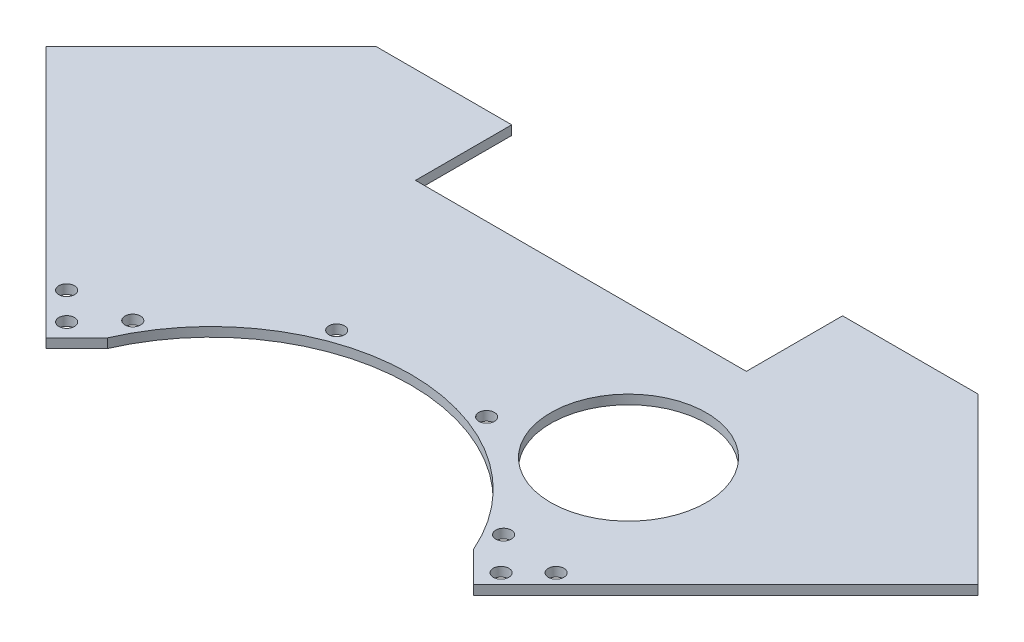
ISO-10303-21;
HEADER;
FILE_DESCRIPTION(('STEP AP214'),'2;1');
FILE_NAME('part.step','',(''),(''),'','','');
FILE_SCHEMA(('AUTOMOTIVE_DESIGN { 1 0 10303 214 1 1 1 1 }'));
ENDSEC;
DATA;
#1=APPLICATION_CONTEXT('core data for automotive mechanical design processes');
#2=APPLICATION_PROTOCOL_DEFINITION('international standard','automotive_design',2000,#1);
#3=PRODUCT_CONTEXT('',#1,'mechanical');
#4=PRODUCT('Part','Part','',(#3));
#5=PRODUCT_RELATED_PRODUCT_CATEGORY('part','',(#4));
#6=PRODUCT_DEFINITION_FORMATION('','',#4);
#7=PRODUCT_DEFINITION_CONTEXT('part definition',#1,'design');
#8=PRODUCT_DEFINITION('design','',#6,#7);
#9=PRODUCT_DEFINITION_SHAPE('','',#8);
#10=(LENGTH_UNIT() NAMED_UNIT(*) SI_UNIT(.MILLI.,.METRE.));
#11=(NAMED_UNIT(*) PLANE_ANGLE_UNIT() SI_UNIT($,.RADIAN.));
#12=(NAMED_UNIT(*) SI_UNIT($,.STERADIAN.) SOLID_ANGLE_UNIT());
#13=UNCERTAINTY_MEASURE_WITH_UNIT(LENGTH_MEASURE(1.E-05),#10,'distance_accuracy_value','');
#14=(GEOMETRIC_REPRESENTATION_CONTEXT(3) GLOBAL_UNCERTAINTY_ASSIGNED_CONTEXT((#13)) GLOBAL_UNIT_ASSIGNED_CONTEXT((#10,
#11,#12)) REPRESENTATION_CONTEXT('',''));
#15=CARTESIAN_POINT('',(0.,0.,0.));
#16=DIRECTION('',(0.,0.,1.));
#17=DIRECTION('',(1.,0.,0.));
#18=AXIS2_PLACEMENT_3D('',#15,#16,#17);
#19=CARTESIAN_POINT('',(0.,1.5113,0.));
#20=DIRECTION('',(0.,-1.,0.));
#21=DIRECTION('',(0.,0.,-1.));
#22=AXIS2_PLACEMENT_3D('',#19,#20,#21);
#23=CYLINDRICAL_SURFACE('',#22,65.0875);
#24=DIRECTION('',(0.,1.,0.));
#25=VECTOR('',#24,1.);
#26=CARTESIAN_POINT('',(-59.7182060728444,-1.5113,-25.8866475174228));
#27=LINE('',#26,#25);
#28=CARTESIAN_POINT('',(-59.7182060728444,-1.5113,-25.8866475174228));
#29=VERTEX_POINT('',#28);
#30=CARTESIAN_POINT('',(-59.7182060728444,1.5113,-25.8866475174228));
#31=VERTEX_POINT('',#30);
#32=EDGE_CURVE('E124',#29,#31,#27,.T.);
#33=ORIENTED_EDGE('',*,*,#32,.F.);
#34=CARTESIAN_POINT('',(0.,-1.5113,0.));
#35=DIRECTION('',(0.,-1.,0.));
#36=DIRECTION('',(0.,0.,-1.));
#37=AXIS2_PLACEMENT_3D('',#34,#35,#36);
#38=CIRCLE('',#37,65.0875);
#39=CARTESIAN_POINT('',(59.7182060728444,-1.5113,-25.8866475174228));
#40=VERTEX_POINT('',#39);
#41=EDGE_CURVE('E57',#29,#40,#38,.T.);
#42=ORIENTED_EDGE('',*,*,#41,.T.);
#43=DIRECTION('',(0.,1.,0.));
#44=VECTOR('',#43,1.);
#45=CARTESIAN_POINT('',(59.7182060728444,-1.5113,-25.8866475174228));
#46=LINE('',#45,#44);
#47=CARTESIAN_POINT('',(59.7182060728444,1.5113,-25.8866475174228));
#48=VERTEX_POINT('',#47);
#49=EDGE_CURVE('E243',#40,#48,#46,.T.);
#50=ORIENTED_EDGE('',*,*,#49,.T.);
#51=CARTESIAN_POINT('',(0.,1.5113,0.));
#52=DIRECTION('',(0.,-1.,0.));
#53=DIRECTION('',(0.,0.,-1.));
#54=AXIS2_PLACEMENT_3D('',#51,#52,#53);
#55=CIRCLE('',#54,65.0875);
#56=EDGE_CURVE('E132',#31,#48,#55,.T.);
#57=ORIENTED_EDGE('',*,*,#56,.F.);
#58=EDGE_LOOP('',(#33,#42,#50,#57));
#59=FACE_BOUND('',#58,.T.);
#60=ADVANCED_FACE('F35',(#59),#23,.F.);
#61=CARTESIAN_POINT('',(-152.04785216647,1.5113,-98.1663154400551));
#62=DIRECTION('',(0.707106781186547,0.,-0.707106781186548));
#63=DIRECTION('',(-0.707106781186548,0.,-0.707106781186547));
#64=AXIS2_PLACEMENT_3D('',#61,#62,#63);
#65=PLANE('',#64);
#66=DIRECTION('',(0.,1.,0.));
#67=VECTOR('',#66,1.);
#68=CARTESIAN_POINT('',(-69.7431951583412,-1.5113,-15.861658431926));
#69=LINE('',#68,#67);
#70=CARTESIAN_POINT('',(-69.7431951583411,-1.5113,-15.861658431926));
#71=VERTEX_POINT('',#70);
#72=CARTESIAN_POINT('',(-69.7431951583412,1.5113,-15.861658431926));
#73=VERTEX_POINT('',#72);
#74=EDGE_CURVE('E49',#71,#73,#69,.T.);
#75=ORIENTED_EDGE('',*,*,#74,.T.);
#76=DIRECTION('',(0.707106781186548,0.,0.707106781186547));
#77=VECTOR('',#76,1.);
#78=CARTESIAN_POINT('',(-152.04785216647,1.5113,-98.1663154400551));
#79=LINE('',#78,#77);
#80=CARTESIAN_POINT('',(-152.04785216647,1.5113,-98.1663154400551));
#81=VERTEX_POINT('',#80);
#82=EDGE_CURVE('E147',#81,#73,#79,.T.);
#83=ORIENTED_EDGE('',*,*,#82,.F.);
#84=DIRECTION('',(0.,-1.,0.));
#85=VECTOR('',#84,1.);
#86=CARTESIAN_POINT('',(-152.04785216647,1.5113,-98.1663154400551));
#87=LINE('',#86,#85);
#88=CARTESIAN_POINT('',(-152.04785216647,-1.5113,-98.1663154400551));
#89=VERTEX_POINT('',#88);
#90=EDGE_CURVE('E165',#81,#89,#87,.T.);
#91=ORIENTED_EDGE('',*,*,#90,.T.);
#92=DIRECTION('',(0.707106781186548,0.,0.707106781186547));
#93=VECTOR('',#92,1.);
#94=CARTESIAN_POINT('',(-152.04785216647,-1.5113,-98.1663154400551));
#95=LINE('',#94,#93);
#96=EDGE_CURVE('E163',#89,#71,#95,.T.);
#97=ORIENTED_EDGE('',*,*,#96,.T.);
#98=EDGE_LOOP('',(#75,#83,#91,#97));
#99=FACE_BOUND('',#98,.T.);
#100=ADVANCED_FACE('F222',(#99),#65,.F.);
#101=CARTESIAN_POINT('',(0.,1.5113,0.));
#102=DIRECTION('',(0.,-1.,0.));
#103=DIRECTION('',(0.,0.,-1.));
#104=AXIS2_PLACEMENT_3D('',#101,#102,#103);
#105=PLANE('',#104);
#106=CARTESIAN_POINT('',(59.1287540950455,1.5113,-77.0580926011515));
#107=DIRECTION('',(0.,1.,0.));
#108=DIRECTION('',(0.,0.,1.));
#109=AXIS2_PLACEMENT_3D('',#106,#107,#108);
#110=CIRCLE('',#109,25.4);
#111=CARTESIAN_POINT('',(59.1287540950455,1.5113,-51.6580926011515));
#112=VERTEX_POINT('',#111);
#113=EDGE_CURVE('E398',#112,#112,#110,.T.);
#114=ORIENTED_EDGE('',*,*,#113,.F.);
#115=EDGE_LOOP('',(#114));
#116=FACE_BOUND('',#115,.T.);
#117=CARTESIAN_POINT('',(-70.8657271734748,1.5113,-23.7193825378615));
#118=DIRECTION('',(0.,-1.,0.));
#119=DIRECTION('',(0.,0.,1.));
#120=AXIS2_PLACEMENT_3D('',#117,#118,#119);
#121=CIRCLE('',#120,2.55270000000001);
#122=CARTESIAN_POINT('',(-70.8657271734748,1.5113,-21.1666825378615));
#123=VERTEX_POINT('',#122);
#124=EDGE_CURVE('E404',#123,#123,#121,.T.);
#125=ORIENTED_EDGE('',*,*,#124,.T.);
#126=EDGE_LOOP('',(#125));
#127=FACE_BOUND('',#126,.T.);
#128=CARTESIAN_POINT('',(-79.8459832945439,1.5113,-32.6996386589307));
#129=DIRECTION('',(0.,-1.,0.));
#130=DIRECTION('',(0.,0.,1.));
#131=AXIS2_PLACEMENT_3D('',#128,#129,#130);
#132=CIRCLE('',#131,2.55270000000001);
#133=CARTESIAN_POINT('',(-79.8459832945439,1.5113,-30.1469386589307));
#134=VERTEX_POINT('',#133);
#135=EDGE_CURVE('E400',#134,#134,#132,.T.);
#136=ORIENTED_EDGE('',*,*,#135,.T.);
#137=EDGE_LOOP('',(#136));
#138=FACE_BOUND('',#137,.T.);
#139=CARTESIAN_POINT('',(24.4619855809739,1.5113,-65.4265524190006));
#140=DIRECTION('',(0.,1.,0.));
#141=DIRECTION('',(0.,0.,1.));
#142=AXIS2_PLACEMENT_3D('',#139,#140,#141);
#143=CIRCLE('',#142,2.5527);
#144=CARTESIAN_POINT('',(24.4619855809739,1.5113,-62.8738524190006));
#145=VERTEX_POINT('',#144);
#146=EDGE_CURVE('E144',#145,#145,#143,.T.);
#147=ORIENTED_EDGE('',*,*,#146,.F.);
#148=EDGE_LOOP('',(#147));
#149=FACE_BOUND('',#148,.T.);
#150=CARTESIAN_POINT('',(60.491874454343,1.5113,-34.9250000000001));
#151=DIRECTION('',(0.,1.,0.));
#152=DIRECTION('',(0.,0.,1.));
#153=AXIS2_PLACEMENT_3D('',#150,#151,#152);
#154=CIRCLE('',#153,2.5527);
#155=CARTESIAN_POINT('',(60.491874454343,1.5113,-32.3723000000001));
#156=VERTEX_POINT('',#155);
#157=EDGE_CURVE('E250',#156,#156,#154,.T.);
#158=ORIENTED_EDGE('',*,*,#157,.F.);
#159=EDGE_LOOP('',(#158));
#160=FACE_BOUND('',#159,.T.);
#161=CARTESIAN_POINT('',(-60.491874454343,1.5113,-34.9250000000001));
#162=DIRECTION('',(0.,1.,0.));
#163=DIRECTION('',(0.,0.,-1.));
#164=AXIS2_PLACEMENT_3D('',#161,#162,#163);
#165=CIRCLE('',#164,2.5527);
#166=CARTESIAN_POINT('',(-60.491874454343,1.5113,-37.4777000000001));
#167=VERTEX_POINT('',#166);
#168=EDGE_CURVE('E256',#167,#167,#165,.T.);
#169=ORIENTED_EDGE('',*,*,#168,.F.);
#170=EDGE_LOOP('',(#169));
#171=FACE_BOUND('',#170,.T.);
#172=CARTESIAN_POINT('',(-24.4619855809739,1.5113,-65.4265524190006));
#173=DIRECTION('',(0.,1.,0.));
#174=DIRECTION('',(0.,0.,-1.));
#175=AXIS2_PLACEMENT_3D('',#172,#173,#174);
#176=CIRCLE('',#175,2.5527);
#177=CARTESIAN_POINT('',(-24.4619855809739,1.5113,-67.9792524190005));
#178=VERTEX_POINT('',#177);
#179=EDGE_CURVE('E245',#178,#178,#176,.T.);
#180=ORIENTED_EDGE('',*,*,#179,.F.);
#181=EDGE_LOOP('',(#180));
#182=FACE_BOUND('',#181,.T.);
#183=CARTESIAN_POINT('',(79.8459832945439,1.5113,-32.6996386589307));
#184=DIRECTION('',(0.,1.,0.));
#185=DIRECTION('',(0.,0.,1.));
#186=AXIS2_PLACEMENT_3D('',#183,#184,#185);
#187=CIRCLE('',#186,2.55270000000001);
#188=CARTESIAN_POINT('',(79.8459832945439,1.5113,-30.1469386589307));
#189=VERTEX_POINT('',#188);
#190=EDGE_CURVE('E223',#189,#189,#187,.T.);
#191=ORIENTED_EDGE('',*,*,#190,.F.);
#192=EDGE_LOOP('',(#191));
#193=FACE_BOUND('',#192,.T.);
#194=CARTESIAN_POINT('',(70.8657271734748,1.5113,-23.7193825378615));
#195=DIRECTION('',(0.,1.,0.));
#196=DIRECTION('',(0.,0.,1.));
#197=AXIS2_PLACEMENT_3D('',#194,#195,#196);
#198=CIRCLE('',#197,2.55270000000001);
#199=CARTESIAN_POINT('',(70.8657271734748,1.5113,-21.1666825378615));
#200=VERTEX_POINT('',#199);
#201=EDGE_CURVE('E234',#200,#200,#198,.T.);
#202=ORIENTED_EDGE('',*,*,#201,.F.);
#203=EDGE_LOOP('',(#202));
#204=FACE_BOUND('',#203,.T.);
#205=DIRECTION('',(0.707106781186548,0.,-0.707106781186547));
#206=VECTOR('',#205,1.);
#207=CARTESIAN_POINT('',(-69.7431951583412,1.5113,-15.861658431926));
#208=LINE('',#207,#206);
#209=EDGE_CURVE('E129',#73,#31,#208,.T.);
#210=ORIENTED_EDGE('',*,*,#209,.T.);
#211=ORIENTED_EDGE('',*,*,#56,.T.);
#212=DIRECTION('',(-0.707106781186542,0.,-0.707106781186554));
#213=VECTOR('',#212,1.);
#214=CARTESIAN_POINT('',(60.762939037272,1.5113,-24.8419145529951));
#215=LINE('',#214,#213);
#216=CARTESIAN_POINT('',(69.7431951583412,1.5113,-15.861658431926));
#217=VERTEX_POINT('',#216);
#218=EDGE_CURVE('E233',#217,#48,#215,.T.);
#219=ORIENTED_EDGE('',*,*,#218,.F.);
#220=DIRECTION('',(0.707106781186548,0.,-0.707106781186547));
#221=VECTOR('',#220,1.);
#222=CARTESIAN_POINT('',(64.255461556707,1.5113,-10.3739248302919));
#223=LINE('',#222,#221);
#224=CARTESIAN_POINT('',(152.04785216647,1.5113,-98.1663154400552));
#225=VERTEX_POINT('',#224);
#226=EDGE_CURVE('E267',#217,#225,#223,.T.);
#227=ORIENTED_EDGE('',*,*,#226,.T.);
#228=DIRECTION('',(-0.707106781186548,0.,-0.707106781186547));
#229=VECTOR('',#228,1.);
#230=CARTESIAN_POINT('',(152.04785216647,1.5113,-98.1663154400552));
#231=LINE('',#230,#229);
#232=CARTESIAN_POINT('',(98.1663154400552,1.5113,-152.04785216647));
#233=VERTEX_POINT('',#232);
#234=EDGE_CURVE('E269',#225,#233,#231,.T.);
#235=ORIENTED_EDGE('',*,*,#234,.T.);
#236=DIRECTION('',(-1.,0.,0.));
#237=VECTOR('',#236,1.);
#238=CARTESIAN_POINT('',(98.1663154400552,1.5113,-152.04785216647));
#239=LINE('',#238,#237);
#240=CARTESIAN_POINT('',(53.9750000000001,1.5113,-152.04785216647));
#241=VERTEX_POINT('',#240);
#242=EDGE_CURVE('E189',#233,#241,#239,.T.);
#243=ORIENTED_EDGE('',*,*,#242,.T.);
#244=DIRECTION('',(0.,0.,1.));
#245=VECTOR('',#244,1.);
#246=CARTESIAN_POINT('',(53.9750000000001,1.5113,-152.04785216647));
#247=LINE('',#246,#245);
#248=CARTESIAN_POINT('',(53.9750000000001,1.5113,-120.65));
#249=VERTEX_POINT('',#248);
#250=EDGE_CURVE('E208',#241,#249,#247,.T.);
#251=ORIENTED_EDGE('',*,*,#250,.T.);
#252=DIRECTION('',(-1.,0.,0.));
#253=VECTOR('',#252,1.);
#254=CARTESIAN_POINT('',(53.9750000000001,1.5113,-120.65));
#255=LINE('',#254,#253);
#256=CARTESIAN_POINT('',(-53.975,1.5113,-120.65));
#257=VERTEX_POINT('',#256);
#258=EDGE_CURVE('E204',#249,#257,#255,.T.);
#259=ORIENTED_EDGE('',*,*,#258,.T.);
#260=DIRECTION('',(0.,0.,-1.));
#261=VECTOR('',#260,1.);
#262=CARTESIAN_POINT('',(-53.975,1.5113,-120.65));
#263=LINE('',#262,#261);
#264=CARTESIAN_POINT('',(-53.975,1.5113,-152.04785216647));
#265=VERTEX_POINT('',#264);
#266=EDGE_CURVE('E207',#257,#265,#263,.T.);
#267=ORIENTED_EDGE('',*,*,#266,.T.);
#268=DIRECTION('',(-1.,0.,0.));
#269=VECTOR('',#268,1.);
#270=CARTESIAN_POINT('',(-53.975,1.5113,-152.04785216647));
#271=LINE('',#270,#269);
#272=CARTESIAN_POINT('',(-98.1663154400551,1.5113,-152.04785216647));
#273=VERTEX_POINT('',#272);
#274=EDGE_CURVE('E210',#265,#273,#271,.T.);
#275=ORIENTED_EDGE('',*,*,#274,.T.);
#276=DIRECTION('',(-0.707106781186547,0.,0.707106781186547));
#277=VECTOR('',#276,1.);
#278=CARTESIAN_POINT('',(-98.1663154400551,1.5113,-152.04785216647));
#279=LINE('',#278,#277);
#280=EDGE_CURVE('E215',#273,#81,#279,.T.);
#281=ORIENTED_EDGE('',*,*,#280,.T.);
#282=ORIENTED_EDGE('',*,*,#82,.T.);
#283=EDGE_LOOP('',(#210,#211,#219,#227,#235,#243,#251,#259,#267,#275,#281,#282));
#284=FACE_BOUND('',#283,.T.);
#285=ADVANCED_FACE('F220',(#116,#127,#138,#149,#160,#171,#182,#193,#204,#284),#105,.F.);
#286=CARTESIAN_POINT('',(0.,-1.5113,0.));
#287=DIRECTION('',(0.,-1.,0.));
#288=DIRECTION('',(0.,0.,-1.));
#289=AXIS2_PLACEMENT_3D('',#286,#287,#288);
#290=PLANE('',#289);
#291=CARTESIAN_POINT('',(59.1287540950455,-1.5113,-77.0580926011515));
#292=DIRECTION('',(0.,1.,0.));
#293=DIRECTION('',(0.,0.,1.));
#294=AXIS2_PLACEMENT_3D('',#291,#292,#293);
#295=CIRCLE('',#294,25.4);
#296=CARTESIAN_POINT('',(59.1287540950455,-1.5113,-51.6580926011515));
#297=VERTEX_POINT('',#296);
#298=EDGE_CURVE('E336',#297,#297,#295,.T.);
#299=ORIENTED_EDGE('',*,*,#298,.T.);
#300=EDGE_LOOP('',(#299));
#301=FACE_BOUND('',#300,.T.);
#302=CARTESIAN_POINT('',(-70.8657271734748,-1.5113,-23.7193825378615));
#303=DIRECTION('',(0.,-1.,0.));
#304=DIRECTION('',(0.,0.,1.));
#305=AXIS2_PLACEMENT_3D('',#302,#303,#304);
#306=CIRCLE('',#305,2.55270000000001);
#307=CARTESIAN_POINT('',(-70.8657271734748,-1.5113,-21.1666825378615));
#308=VERTEX_POINT('',#307);
#309=EDGE_CURVE('E340',#308,#308,#306,.T.);
#310=ORIENTED_EDGE('',*,*,#309,.F.);
#311=EDGE_LOOP('',(#310));
#312=FACE_BOUND('',#311,.T.);
#313=CARTESIAN_POINT('',(-79.8459832945439,-1.5113,-32.6996386589307));
#314=DIRECTION('',(0.,-1.,0.));
#315=DIRECTION('',(0.,0.,1.));
#316=AXIS2_PLACEMENT_3D('',#313,#314,#315);
#317=CIRCLE('',#316,2.55270000000001);
#318=CARTESIAN_POINT('',(-79.8459832945439,-1.5113,-30.1469386589307));
#319=VERTEX_POINT('',#318);
#320=EDGE_CURVE('E344',#319,#319,#317,.T.);
#321=ORIENTED_EDGE('',*,*,#320,.F.);
#322=EDGE_LOOP('',(#321));
#323=FACE_BOUND('',#322,.T.);
#324=CARTESIAN_POINT('',(70.8657271734748,-1.5113,-23.7193825378615));
#325=DIRECTION('',(0.,1.,0.));
#326=DIRECTION('',(0.,0.,1.));
#327=AXIS2_PLACEMENT_3D('',#324,#325,#326);
#328=CIRCLE('',#327,2.55270000000001);
#329=CARTESIAN_POINT('',(70.8657271734748,-1.5113,-21.1666825378615));
#330=VERTEX_POINT('',#329);
#331=EDGE_CURVE('E230',#330,#330,#328,.T.);
#332=ORIENTED_EDGE('',*,*,#331,.T.);
#333=EDGE_LOOP('',(#332));
#334=FACE_BOUND('',#333,.T.);
#335=CARTESIAN_POINT('',(79.8459832945439,-1.5113,-32.6996386589307));
#336=DIRECTION('',(0.,1.,0.));
#337=DIRECTION('',(0.,0.,1.));
#338=AXIS2_PLACEMENT_3D('',#335,#336,#337);
#339=CIRCLE('',#338,2.55270000000001);
#340=CARTESIAN_POINT('',(79.8459832945439,-1.5113,-30.1469386589307));
#341=VERTEX_POINT('',#340);
#342=EDGE_CURVE('E226',#341,#341,#339,.T.);
#343=ORIENTED_EDGE('',*,*,#342,.T.);
#344=EDGE_LOOP('',(#343));
#345=FACE_BOUND('',#344,.T.);
#346=CARTESIAN_POINT('',(-24.4619855809739,-1.5113,-65.4265524190006));
#347=DIRECTION('',(0.,1.,0.));
#348=DIRECTION('',(0.,0.,-1.));
#349=AXIS2_PLACEMENT_3D('',#346,#347,#348);
#350=CIRCLE('',#349,2.5527);
#351=CARTESIAN_POINT('',(-24.4619855809739,-1.5113,-67.9792524190005));
#352=VERTEX_POINT('',#351);
#353=EDGE_CURVE('E259',#352,#352,#350,.T.);
#354=ORIENTED_EDGE('',*,*,#353,.T.);
#355=EDGE_LOOP('',(#354));
#356=FACE_BOUND('',#355,.T.);
#357=CARTESIAN_POINT('',(-60.491874454343,-1.5113,-34.9250000000001));
#358=DIRECTION('',(0.,1.,0.));
#359=DIRECTION('',(0.,0.,-1.));
#360=AXIS2_PLACEMENT_3D('',#357,#358,#359);
#361=CIRCLE('',#360,2.5527);
#362=CARTESIAN_POINT('',(-60.491874454343,-1.5113,-37.4777000000001));
#363=VERTEX_POINT('',#362);
#364=EDGE_CURVE('E253',#363,#363,#361,.T.);
#365=ORIENTED_EDGE('',*,*,#364,.T.);
#366=EDGE_LOOP('',(#365));
#367=FACE_BOUND('',#366,.T.);
#368=CARTESIAN_POINT('',(60.491874454343,-1.5113,-34.9250000000001));
#369=DIRECTION('',(0.,1.,0.));
#370=DIRECTION('',(0.,0.,1.));
#371=AXIS2_PLACEMENT_3D('',#368,#369,#370);
#372=CIRCLE('',#371,2.5527);
#373=CARTESIAN_POINT('',(60.491874454343,-1.5113,-32.3723000000001));
#374=VERTEX_POINT('',#373);
#375=EDGE_CURVE('E247',#374,#374,#372,.T.);
#376=ORIENTED_EDGE('',*,*,#375,.T.);
#377=EDGE_LOOP('',(#376));
#378=FACE_BOUND('',#377,.T.);
#379=CARTESIAN_POINT('',(24.4619855809739,-1.5113,-65.4265524190006));
#380=DIRECTION('',(0.,1.,0.));
#381=DIRECTION('',(0.,0.,1.));
#382=AXIS2_PLACEMENT_3D('',#379,#380,#381);
#383=CIRCLE('',#382,2.5527);
#384=CARTESIAN_POINT('',(24.4619855809739,-1.5113,-62.8738524190006));
#385=VERTEX_POINT('',#384);
#386=EDGE_CURVE('E139',#385,#385,#383,.T.);
#387=ORIENTED_EDGE('',*,*,#386,.T.);
#388=EDGE_LOOP('',(#387));
#389=FACE_BOUND('',#388,.T.);
#390=ORIENTED_EDGE('',*,*,#41,.F.);
#391=DIRECTION('',(0.707106781186542,0.,-0.707106781186554));
#392=VECTOR('',#391,1.);
#393=CARTESIAN_POINT('',(-60.762939037272,-1.5113,-24.8419145529951));
#394=LINE('',#393,#392);
#395=EDGE_CURVE('E122',#71,#29,#394,.T.);
#396=ORIENTED_EDGE('',*,*,#395,.F.);
#397=ORIENTED_EDGE('',*,*,#96,.F.);
#398=DIRECTION('',(-0.707106781186547,0.,0.707106781186547));
#399=VECTOR('',#398,1.);
#400=CARTESIAN_POINT('',(-98.1663154400551,-1.5113,-152.04785216647));
#401=LINE('',#400,#399);
#402=CARTESIAN_POINT('',(-98.1663154400551,-1.5113,-152.04785216647));
#403=VERTEX_POINT('',#402);
#404=EDGE_CURVE('E161',#403,#89,#401,.T.);
#405=ORIENTED_EDGE('',*,*,#404,.F.);
#406=DIRECTION('',(-1.,0.,0.));
#407=VECTOR('',#406,1.);
#408=CARTESIAN_POINT('',(-53.975,-1.5113,-152.04785216647));
#409=LINE('',#408,#407);
#410=CARTESIAN_POINT('',(-53.975,-1.5113,-152.04785216647));
#411=VERTEX_POINT('',#410);
#412=EDGE_CURVE('E159',#411,#403,#409,.T.);
#413=ORIENTED_EDGE('',*,*,#412,.F.);
#414=DIRECTION('',(0.,0.,-1.));
#415=VECTOR('',#414,1.);
#416=CARTESIAN_POINT('',(-53.975,-1.5113,-120.65));
#417=LINE('',#416,#415);
#418=CARTESIAN_POINT('',(-53.975,-1.5113,-120.65));
#419=VERTEX_POINT('',#418);
#420=EDGE_CURVE('E157',#419,#411,#417,.T.);
#421=ORIENTED_EDGE('',*,*,#420,.F.);
#422=DIRECTION('',(-1.,0.,0.));
#423=VECTOR('',#422,1.);
#424=CARTESIAN_POINT('',(53.9750000000001,-1.5113,-120.65));
#425=LINE('',#424,#423);
#426=CARTESIAN_POINT('',(53.9750000000001,-1.5113,-120.65));
#427=VERTEX_POINT('',#426);
#428=EDGE_CURVE('E155',#427,#419,#425,.T.);
#429=ORIENTED_EDGE('',*,*,#428,.F.);
#430=DIRECTION('',(0.,0.,1.));
#431=VECTOR('',#430,1.);
#432=CARTESIAN_POINT('',(53.9750000000001,-1.5113,-152.04785216647));
#433=LINE('',#432,#431);
#434=CARTESIAN_POINT('',(53.9750000000001,-1.5113,-152.04785216647));
#435=VERTEX_POINT('',#434);
#436=EDGE_CURVE('E153',#435,#427,#433,.T.);
#437=ORIENTED_EDGE('',*,*,#436,.F.);
#438=DIRECTION('',(-1.,0.,0.));
#439=VECTOR('',#438,1.);
#440=CARTESIAN_POINT('',(98.1663154400552,-1.5113,-152.04785216647));
#441=LINE('',#440,#439);
#442=CARTESIAN_POINT('',(98.1663154400552,-1.5113,-152.04785216647));
#443=VERTEX_POINT('',#442);
#444=EDGE_CURVE('E151',#443,#435,#441,.T.);
#445=ORIENTED_EDGE('',*,*,#444,.F.);
#446=DIRECTION('',(-0.707106781186548,0.,-0.707106781186547));
#447=VECTOR('',#446,1.);
#448=CARTESIAN_POINT('',(152.04785216647,-1.5113,-98.1663154400552));
#449=LINE('',#448,#447);
#450=CARTESIAN_POINT('',(152.04785216647,-1.5113,-98.1663154400552));
#451=VERTEX_POINT('',#450);
#452=EDGE_CURVE('E141',#451,#443,#449,.T.);
#453=ORIENTED_EDGE('',*,*,#452,.F.);
#454=DIRECTION('',(0.707106781186548,0.,-0.707106781186547));
#455=VECTOR('',#454,1.);
#456=CARTESIAN_POINT('',(64.255461556707,-1.5113,-10.3739248302919));
#457=LINE('',#456,#455);
#458=CARTESIAN_POINT('',(69.7431951583412,-1.5113,-15.861658431926));
#459=VERTEX_POINT('',#458);
#460=EDGE_CURVE('E138',#459,#451,#457,.T.);
#461=ORIENTED_EDGE('',*,*,#460,.F.);
#462=DIRECTION('',(-0.707106781186548,0.,-0.707106781186547));
#463=VECTOR('',#462,1.);
#464=CARTESIAN_POINT('',(69.7431951583412,-1.5113,-15.861658431926));
#465=LINE('',#464,#463);
#466=EDGE_CURVE('E137',#459,#40,#465,.T.);
#467=ORIENTED_EDGE('',*,*,#466,.T.);
#468=EDGE_LOOP('',(#390,#396,#397,#405,#413,#421,#429,#437,#445,#453,#461,#467));
#469=FACE_BOUND('',#468,.T.);
#470=ADVANCED_FACE('F135',(#301,#312,#323,#334,#345,#356,#367,#378,#389,#469),#290,.T.);
#471=CARTESIAN_POINT('',(64.255461556707,1.5113,-10.3739248302919));
#472=DIRECTION('',(-0.707106781186547,0.,-0.707106781186548));
#473=DIRECTION('',(-0.707106781186548,0.,0.707106781186547));
#474=AXIS2_PLACEMENT_3D('',#471,#472,#473);
#475=PLANE('',#474);
#476=ORIENTED_EDGE('',*,*,#226,.F.);
#477=DIRECTION('',(0.,1.,0.));
#478=VECTOR('',#477,1.);
#479=CARTESIAN_POINT('',(69.7431951583412,-1.5113,-15.861658431926));
#480=LINE('',#479,#478);
#481=EDGE_CURVE('E240',#459,#217,#480,.T.);
#482=ORIENTED_EDGE('',*,*,#481,.F.);
#483=ORIENTED_EDGE('',*,*,#460,.T.);
#484=DIRECTION('',(0.,-1.,0.));
#485=VECTOR('',#484,1.);
#486=CARTESIAN_POINT('',(152.04785216647,1.5113,-98.1663154400552));
#487=LINE('',#486,#485);
#488=EDGE_CURVE('E11',#225,#451,#487,.T.);
#489=ORIENTED_EDGE('',*,*,#488,.F.);
#490=EDGE_LOOP('',(#476,#482,#483,#489));
#491=FACE_BOUND('',#490,.T.);
#492=ADVANCED_FACE('F275',(#491),#475,.F.);
#493=CARTESIAN_POINT('',(152.04785216647,1.5113,-98.1663154400552));
#494=DIRECTION('',(-0.707106781186547,0.,0.707106781186548));
#495=DIRECTION('',(0.707106781186548,0.,0.707106781186547));
#496=AXIS2_PLACEMENT_3D('',#493,#494,#495);
#497=PLANE('',#496);
#498=ORIENTED_EDGE('',*,*,#452,.T.);
#499=DIRECTION('',(0.,-1.,0.));
#500=VECTOR('',#499,1.);
#501=CARTESIAN_POINT('',(98.1663154400552,1.5113,-152.04785216647));
#502=LINE('',#501,#500);
#503=EDGE_CURVE('E42',#233,#443,#502,.T.);
#504=ORIENTED_EDGE('',*,*,#503,.F.);
#505=ORIENTED_EDGE('',*,*,#234,.F.);
#506=ORIENTED_EDGE('',*,*,#488,.T.);
#507=EDGE_LOOP('',(#498,#504,#505,#506));
#508=FACE_BOUND('',#507,.T.);
#509=ADVANCED_FACE('F273',(#508),#497,.F.);
#510=CARTESIAN_POINT('',(98.1663154400552,1.5113,-152.04785216647));
#511=DIRECTION('',(0.,0.,1.));
#512=DIRECTION('',(1.,0.,0.));
#513=AXIS2_PLACEMENT_3D('',#510,#511,#512);
#514=PLANE('',#513);
#515=ORIENTED_EDGE('',*,*,#444,.T.);
#516=DIRECTION('',(0.,-1.,0.));
#517=VECTOR('',#516,1.);
#518=CARTESIAN_POINT('',(53.9750000000001,1.5113,-152.04785216647));
#519=LINE('',#518,#517);
#520=EDGE_CURVE('E180',#241,#435,#519,.T.);
#521=ORIENTED_EDGE('',*,*,#520,.F.);
#522=ORIENTED_EDGE('',*,*,#242,.F.);
#523=ORIENTED_EDGE('',*,*,#503,.T.);
#524=EDGE_LOOP('',(#515,#521,#522,#523));
#525=FACE_BOUND('',#524,.T.);
#526=ADVANCED_FACE('F187',(#525),#514,.F.);
#527=CARTESIAN_POINT('',(53.9750000000001,1.5113,-152.04785216647));
#528=DIRECTION('',(1.,0.,0.));
#529=DIRECTION('',(0.,0.,-1.));
#530=AXIS2_PLACEMENT_3D('',#527,#528,#529);
#531=PLANE('',#530);
#532=ORIENTED_EDGE('',*,*,#436,.T.);
#533=DIRECTION('',(0.,-1.,0.));
#534=VECTOR('',#533,1.);
#535=CARTESIAN_POINT('',(53.9750000000001,1.5113,-120.65));
#536=LINE('',#535,#534);
#537=EDGE_CURVE('E177',#249,#427,#536,.T.);
#538=ORIENTED_EDGE('',*,*,#537,.F.);
#539=ORIENTED_EDGE('',*,*,#250,.F.);
#540=ORIENTED_EDGE('',*,*,#520,.T.);
#541=EDGE_LOOP('',(#532,#538,#539,#540));
#542=FACE_BOUND('',#541,.T.);
#543=ADVANCED_FACE('F198',(#542),#531,.F.);
#544=CARTESIAN_POINT('',(53.9750000000001,1.5113,-120.65));
#545=DIRECTION('',(0.,0.,1.));
#546=DIRECTION('',(1.,0.,0.));
#547=AXIS2_PLACEMENT_3D('',#544,#545,#546);
#548=PLANE('',#547);
#549=ORIENTED_EDGE('',*,*,#428,.T.);
#550=DIRECTION('',(0.,-1.,0.));
#551=VECTOR('',#550,1.);
#552=CARTESIAN_POINT('',(-53.975,1.5113,-120.65));
#553=LINE('',#552,#551);
#554=EDGE_CURVE('E174',#257,#419,#553,.T.);
#555=ORIENTED_EDGE('',*,*,#554,.F.);
#556=ORIENTED_EDGE('',*,*,#258,.F.);
#557=ORIENTED_EDGE('',*,*,#537,.T.);
#558=EDGE_LOOP('',(#549,#555,#556,#557));
#559=FACE_BOUND('',#558,.T.);
#560=ADVANCED_FACE('F202',(#559),#548,.F.);
#561=CARTESIAN_POINT('',(-53.975,1.5113,-120.65));
#562=DIRECTION('',(-1.,0.,0.));
#563=DIRECTION('',(0.,0.,1.));
#564=AXIS2_PLACEMENT_3D('',#561,#562,#563);
#565=PLANE('',#564);
#566=ORIENTED_EDGE('',*,*,#420,.T.);
#567=DIRECTION('',(0.,-1.,0.));
#568=VECTOR('',#567,1.);
#569=CARTESIAN_POINT('',(-53.975,1.5113,-152.04785216647));
#570=LINE('',#569,#568);
#571=EDGE_CURVE('E171',#265,#411,#570,.T.);
#572=ORIENTED_EDGE('',*,*,#571,.F.);
#573=ORIENTED_EDGE('',*,*,#266,.F.);
#574=ORIENTED_EDGE('',*,*,#554,.T.);
#575=EDGE_LOOP('',(#566,#572,#573,#574));
#576=FACE_BOUND('',#575,.T.);
#577=ADVANCED_FACE('F314',(#576),#565,.F.);
#578=CARTESIAN_POINT('',(-53.975,1.5113,-152.04785216647));
#579=DIRECTION('',(0.,0.,1.));
#580=DIRECTION('',(1.,0.,0.));
#581=AXIS2_PLACEMENT_3D('',#578,#579,#580);
#582=PLANE('',#581);
#583=ORIENTED_EDGE('',*,*,#412,.T.);
#584=DIRECTION('',(0.,-1.,0.));
#585=VECTOR('',#584,1.);
#586=CARTESIAN_POINT('',(-98.1663154400551,1.5113,-152.04785216647));
#587=LINE('',#586,#585);
#588=EDGE_CURVE('E168',#273,#403,#587,.T.);
#589=ORIENTED_EDGE('',*,*,#588,.F.);
#590=ORIENTED_EDGE('',*,*,#274,.F.);
#591=ORIENTED_EDGE('',*,*,#571,.T.);
#592=EDGE_LOOP('',(#583,#589,#590,#591));
#593=FACE_BOUND('',#592,.T.);
#594=ADVANCED_FACE('F310',(#593),#582,.F.);
#595=CARTESIAN_POINT('',(-98.1663154400551,1.5113,-152.04785216647));
#596=DIRECTION('',(0.707106781186547,0.,0.707106781186547));
#597=DIRECTION('',(0.707106781186548,0.,-0.707106781186548));
#598=AXIS2_PLACEMENT_3D('',#595,#596,#597);
#599=PLANE('',#598);
#600=ORIENTED_EDGE('',*,*,#404,.T.);
#601=ORIENTED_EDGE('',*,*,#90,.F.);
#602=ORIENTED_EDGE('',*,*,#280,.F.);
#603=ORIENTED_EDGE('',*,*,#588,.T.);
#604=EDGE_LOOP('',(#600,#601,#602,#603));
#605=FACE_BOUND('',#604,.T.);
#606=ADVANCED_FACE('F306',(#605),#599,.F.);
#607=CARTESIAN_POINT('',(24.4619855809739,-1.5113,-65.4265524190006));
#608=DIRECTION('',(0.,1.,0.));
#609=DIRECTION('',(0.,0.,1.));
#610=AXIS2_PLACEMENT_3D('',#607,#608,#609);
#611=CYLINDRICAL_SURFACE('',#610,2.5527);
#612=ORIENTED_EDGE('',*,*,#386,.F.);
#613=EDGE_LOOP('',(#612));
#614=FACE_BOUND('',#613,.T.);
#615=ORIENTED_EDGE('',*,*,#146,.T.);
#616=EDGE_LOOP('',(#615));
#617=FACE_BOUND('',#616,.T.);
#618=ADVANCED_FACE('F309',(#614,#617),#611,.F.);
#619=CARTESIAN_POINT('',(60.491874454343,-1.5113,-34.9250000000001));
#620=DIRECTION('',(0.,1.,0.));
#621=DIRECTION('',(0.,0.,1.));
#622=AXIS2_PLACEMENT_3D('',#619,#620,#621);
#623=CYLINDRICAL_SURFACE('',#622,2.5527);
#624=ORIENTED_EDGE('',*,*,#375,.F.);
#625=EDGE_LOOP('',(#624));
#626=FACE_BOUND('',#625,.T.);
#627=ORIENTED_EDGE('',*,*,#157,.T.);
#628=EDGE_LOOP('',(#627));
#629=FACE_BOUND('',#628,.T.);
#630=ADVANCED_FACE('F359',(#626,#629),#623,.F.);
#631=CARTESIAN_POINT('',(-60.491874454343,-1.5113,-34.9250000000001));
#632=DIRECTION('',(0.,1.,0.));
#633=DIRECTION('',(0.,0.,1.));
#634=AXIS2_PLACEMENT_3D('',#631,#632,#633);
#635=CYLINDRICAL_SURFACE('',#634,2.5527);
#636=ORIENTED_EDGE('',*,*,#364,.F.);
#637=EDGE_LOOP('',(#636));
#638=FACE_BOUND('',#637,.T.);
#639=ORIENTED_EDGE('',*,*,#168,.T.);
#640=EDGE_LOOP('',(#639));
#641=FACE_BOUND('',#640,.T.);
#642=ADVANCED_FACE('F290',(#638,#641),#635,.F.);
#643=CARTESIAN_POINT('',(-24.4619855809739,-1.5113,-65.4265524190006));
#644=DIRECTION('',(0.,1.,0.));
#645=DIRECTION('',(0.,0.,1.));
#646=AXIS2_PLACEMENT_3D('',#643,#644,#645);
#647=CYLINDRICAL_SURFACE('',#646,2.5527);
#648=ORIENTED_EDGE('',*,*,#353,.F.);
#649=EDGE_LOOP('',(#648));
#650=FACE_BOUND('',#649,.T.);
#651=ORIENTED_EDGE('',*,*,#179,.T.);
#652=EDGE_LOOP('',(#651));
#653=FACE_BOUND('',#652,.T.);
#654=ADVANCED_FACE('F281',(#650,#653),#647,.F.);
#655=CARTESIAN_POINT('',(60.762939037272,-1.5113,-24.8419145529951));
#656=DIRECTION('',(0.707106781186553,0.,-0.707106781186541));
#657=DIRECTION('',(-0.707106781186542,0.,-0.707106781186553));
#658=AXIS2_PLACEMENT_3D('',#655,#656,#657);
#659=PLANE('',#658);
#660=ORIENTED_EDGE('',*,*,#218,.T.);
#661=ORIENTED_EDGE('',*,*,#49,.F.);
#662=ORIENTED_EDGE('',*,*,#466,.F.);
#663=ORIENTED_EDGE('',*,*,#481,.T.);
#664=EDGE_LOOP('',(#660,#661,#662,#663));
#665=FACE_BOUND('',#664,.T.);
#666=ADVANCED_FACE('F278',(#665),#659,.F.);
#667=CARTESIAN_POINT('',(79.8459832945439,-1.5113,-32.6996386589307));
#668=DIRECTION('',(0.,1.,0.));
#669=DIRECTION('',(0.,0.,1.));
#670=AXIS2_PLACEMENT_3D('',#667,#668,#669);
#671=CYLINDRICAL_SURFACE('',#670,2.55270000000001);
#672=ORIENTED_EDGE('',*,*,#342,.F.);
#673=EDGE_LOOP('',(#672));
#674=FACE_BOUND('',#673,.T.);
#675=ORIENTED_EDGE('',*,*,#190,.T.);
#676=EDGE_LOOP('',(#675));
#677=FACE_BOUND('',#676,.T.);
#678=ADVANCED_FACE('F280',(#674,#677),#671,.F.);
#679=CARTESIAN_POINT('',(70.8657271734748,-1.5113,-23.7193825378615));
#680=DIRECTION('',(0.,1.,0.));
#681=DIRECTION('',(0.,0.,1.));
#682=AXIS2_PLACEMENT_3D('',#679,#680,#681);
#683=CYLINDRICAL_SURFACE('',#682,2.55270000000001);
#684=ORIENTED_EDGE('',*,*,#331,.F.);
#685=EDGE_LOOP('',(#684));
#686=FACE_BOUND('',#685,.T.);
#687=ORIENTED_EDGE('',*,*,#201,.T.);
#688=EDGE_LOOP('',(#687));
#689=FACE_BOUND('',#688,.T.);
#690=ADVANCED_FACE('F287',(#686,#689),#683,.F.);
#691=CARTESIAN_POINT('',(-69.7431951583412,-1.5113,-15.861658431926));
#692=DIRECTION('',(0.707106781186547,0.,0.707106781186548));
#693=DIRECTION('',(0.707106781186548,0.,-0.707106781186547));
#694=AXIS2_PLACEMENT_3D('',#691,#692,#693);
#695=PLANE('',#694);
#696=ORIENTED_EDGE('',*,*,#209,.F.);
#697=ORIENTED_EDGE('',*,*,#74,.F.);
#698=ORIENTED_EDGE('',*,*,#395,.T.);
#699=ORIENTED_EDGE('',*,*,#32,.T.);
#700=EDGE_LOOP('',(#696,#697,#698,#699));
#701=FACE_BOUND('',#700,.T.);
#702=ADVANCED_FACE('F123',(#701),#695,.T.);
#703=CARTESIAN_POINT('',(-79.8459832945439,-1.5113,-32.6996386589307));
#704=DIRECTION('',(0.,1.,0.));
#705=DIRECTION('',(0.,0.,1.));
#706=AXIS2_PLACEMENT_3D('',#703,#704,#705);
#707=CYLINDRICAL_SURFACE('',#706,2.55270000000001);
#708=ORIENTED_EDGE('',*,*,#320,.T.);
#709=EDGE_LOOP('',(#708));
#710=FACE_BOUND('',#709,.T.);
#711=ORIENTED_EDGE('',*,*,#135,.F.);
#712=EDGE_LOOP('',(#711));
#713=FACE_BOUND('',#712,.T.);
#714=ADVANCED_FACE('F380',(#710,#713),#707,.F.);
#715=CARTESIAN_POINT('',(-70.8657271734748,-1.5113,-23.7193825378615));
#716=DIRECTION('',(0.,1.,0.));
#717=DIRECTION('',(0.,0.,1.));
#718=AXIS2_PLACEMENT_3D('',#715,#716,#717);
#719=CYLINDRICAL_SURFACE('',#718,2.55270000000001);
#720=ORIENTED_EDGE('',*,*,#309,.T.);
#721=EDGE_LOOP('',(#720));
#722=FACE_BOUND('',#721,.T.);
#723=ORIENTED_EDGE('',*,*,#124,.F.);
#724=EDGE_LOOP('',(#723));
#725=FACE_BOUND('',#724,.T.);
#726=ADVANCED_FACE('F385',(#722,#725),#719,.F.);
#727=CARTESIAN_POINT('',(59.1287540950455,-1.5113,-77.0580926011515));
#728=DIRECTION('',(0.,1.,0.));
#729=DIRECTION('',(0.,0.,1.));
#730=AXIS2_PLACEMENT_3D('',#727,#728,#729);
#731=CYLINDRICAL_SURFACE('',#730,25.4);
#732=ORIENTED_EDGE('',*,*,#298,.F.);
#733=EDGE_LOOP('',(#732));
#734=FACE_BOUND('',#733,.T.);
#735=ORIENTED_EDGE('',*,*,#113,.T.);
#736=EDGE_LOOP('',(#735));
#737=FACE_BOUND('',#736,.T.);
#738=ADVANCED_FACE('F389',(#734,#737),#731,.F.);
#739=CLOSED_SHELL('',(#60,#100,#285,#470,#492,#509,#526,#543,#560,#577,#594,#606,#618,#630,#642,
#654,#666,#678,#690,#702,#714,#726,#738));
#740=MANIFOLD_SOLID_BREP('B2',#739);
#741=ADVANCED_BREP_SHAPE_REPRESENTATION('',(#18,#740),#14);
#742=SHAPE_DEFINITION_REPRESENTATION(#9,#741);
ENDSEC;
END-ISO-10303-21;
